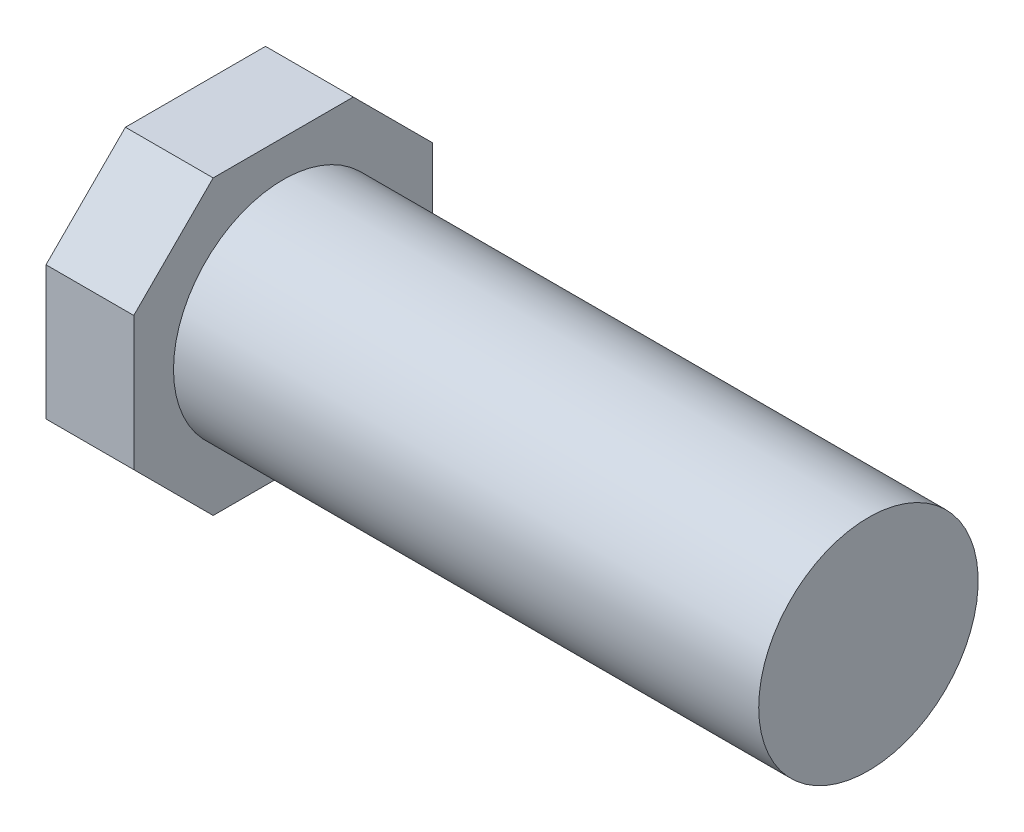
ISO-10303-21;
HEADER;
FILE_DESCRIPTION(('STEP AP214'),'2;1');
FILE_NAME('part.step','',(''),(''),'','','');
FILE_SCHEMA(('AUTOMOTIVE_DESIGN { 1 0 10303 214 1 1 1 1 }'));
ENDSEC;
DATA;
#1=APPLICATION_CONTEXT('core data for automotive mechanical design processes');
#2=APPLICATION_PROTOCOL_DEFINITION('international standard','automotive_design',2000,#1);
#3=PRODUCT_CONTEXT('',#1,'mechanical');
#4=PRODUCT('Part','Part','',(#3));
#5=PRODUCT_RELATED_PRODUCT_CATEGORY('part','',(#4));
#6=PRODUCT_DEFINITION_FORMATION('','',#4);
#7=PRODUCT_DEFINITION_CONTEXT('part definition',#1,'design');
#8=PRODUCT_DEFINITION('design','',#6,#7);
#9=PRODUCT_DEFINITION_SHAPE('','',#8);
#10=(LENGTH_UNIT() NAMED_UNIT(*) SI_UNIT(.MILLI.,.METRE.));
#11=(NAMED_UNIT(*) PLANE_ANGLE_UNIT() SI_UNIT($,.RADIAN.));
#12=(NAMED_UNIT(*) SI_UNIT($,.STERADIAN.) SOLID_ANGLE_UNIT());
#13=UNCERTAINTY_MEASURE_WITH_UNIT(LENGTH_MEASURE(1.E-05),#10,'distance_accuracy_value','');
#14=(GEOMETRIC_REPRESENTATION_CONTEXT(3) GLOBAL_UNCERTAINTY_ASSIGNED_CONTEXT((#13)) GLOBAL_UNIT_ASSIGNED_CONTEXT((#10,
#11,#12)) REPRESENTATION_CONTEXT('',''));
#15=CARTESIAN_POINT('',(0.,0.,0.));
#16=DIRECTION('',(0.,0.,1.));
#17=DIRECTION('',(1.,0.,0.));
#18=AXIS2_PLACEMENT_3D('',#15,#16,#17);
#19=CARTESIAN_POINT('',(74.9692086330936,7.78562045245583,-5.34476642061127));
#20=DIRECTION('',(-1.,0.,0.));
#21=DIRECTION('',(0.,0.,1.));
#22=AXIS2_PLACEMENT_3D('',#19,#20,#21);
#23=CYLINDRICAL_SURFACE('',#22,3.75);
#24=CARTESIAN_POINT('',(74.9692086330936,7.78562045245583,-5.34476642061127));
#25=DIRECTION('',(-1.,0.,0.));
#26=DIRECTION('',(0.,0.,1.));
#27=AXIS2_PLACEMENT_3D('',#24,#25,#26);
#28=CIRCLE('',#27,3.75);
#29=CARTESIAN_POINT('',(74.9692086330936,7.78562045245583,-1.59476642061127));
#30=VERTEX_POINT('',#29);
#31=EDGE_CURVE('E13',#30,#30,#28,.T.);
#32=ORIENTED_EDGE('',*,*,#31,.T.);
#33=EDGE_LOOP('',(#32));
#34=FACE_BOUND('',#33,.T.);
#35=CARTESIAN_POINT('',(54.9692086330936,7.78562045245583,-5.34476642061127));
#36=DIRECTION('',(-1.,0.,0.));
#37=DIRECTION('',(0.,0.,1.));
#38=AXIS2_PLACEMENT_3D('',#35,#36,#37);
#39=CIRCLE('',#38,3.75);
#40=CARTESIAN_POINT('',(54.9692086330936,7.78562045245583,-1.59476642061127));
#41=VERTEX_POINT('',#40);
#42=EDGE_CURVE('E47',#41,#41,#39,.F.);
#43=ORIENTED_EDGE('',*,*,#42,.T.);
#44=EDGE_LOOP('',(#43));
#45=FACE_BOUND('',#44,.T.);
#46=ADVANCED_FACE('F44',(#34,#45),#23,.T.);
#47=CARTESIAN_POINT('',(74.9692086330936,7.78562045245583,-5.34476642061127));
#48=DIRECTION('',(-1.,0.,0.));
#49=DIRECTION('',(0.,0.,1.));
#50=AXIS2_PLACEMENT_3D('',#47,#48,#49);
#51=PLANE('',#50);
#52=ORIENTED_EDGE('',*,*,#31,.F.);
#53=EDGE_LOOP('',(#52));
#54=FACE_BOUND('',#53,.T.);
#55=ADVANCED_FACE('F205',(#54),#51,.F.);
#56=CARTESIAN_POINT('',(54.9692086330936,12.7817875112535,-7.73889016917507));
#57=DIRECTION('',(0.,1.,0.));
#58=DIRECTION('',(0.,0.,1.));
#59=AXIS2_PLACEMENT_3D('',#56,#57,#58);
#60=PLANE('',#59);
#61=DIRECTION('',(0.,0.,-1.));
#62=VECTOR('',#61,1.);
#63=CARTESIAN_POINT('',(51.9692086330936,12.7817875112535,-7.73889016917507));
#64=LINE('',#63,#62);
#65=CARTESIAN_POINT('',(51.9692086330936,12.7817875112535,-2.95064267204748));
#66=VERTEX_POINT('',#65);
#67=CARTESIAN_POINT('',(51.9692086330936,12.7817875112535,-7.73889016917507));
#68=VERTEX_POINT('',#67);
#69=EDGE_CURVE('E140',#66,#68,#64,.T.);
#70=ORIENTED_EDGE('',*,*,#69,.F.);
#71=DIRECTION('',(-1.,0.,0.));
#72=VECTOR('',#71,1.);
#73=CARTESIAN_POINT('',(54.9692086330936,12.7817875112535,-2.95064267204748));
#74=LINE('',#73,#72);
#75=CARTESIAN_POINT('',(54.9692086330936,12.7817875112535,-2.95064267204748));
#76=VERTEX_POINT('',#75);
#77=EDGE_CURVE('E89',#76,#66,#74,.T.);
#78=ORIENTED_EDGE('',*,*,#77,.F.);
#79=DIRECTION('',(0.,0.,-1.));
#80=VECTOR('',#79,1.);
#81=CARTESIAN_POINT('',(54.9692086330936,12.7817875112535,-7.73889016917507));
#82=LINE('',#81,#80);
#83=CARTESIAN_POINT('',(54.9692086330936,12.7817875112535,-7.73889016917507));
#84=VERTEX_POINT('',#83);
#85=EDGE_CURVE('E159',#76,#84,#82,.T.);
#86=ORIENTED_EDGE('',*,*,#85,.T.);
#87=DIRECTION('',(-1.,0.,0.));
#88=VECTOR('',#87,1.);
#89=CARTESIAN_POINT('',(54.9692086330936,12.7817875112535,-7.73889016917507));
#90=LINE('',#89,#88);
#91=EDGE_CURVE('E97',#84,#68,#90,.T.);
#92=ORIENTED_EDGE('',*,*,#91,.T.);
#93=EDGE_LOOP('',(#70,#78,#86,#92));
#94=FACE_BOUND('',#93,.T.);
#95=ADVANCED_FACE('F172',(#94),#60,.T.);
#96=CARTESIAN_POINT('',(54.9692086330936,11.4259112598173,-1.59476642061127));
#97=DIRECTION('',(0.,0.707106781186551,0.707106781186544));
#98=DIRECTION('',(0.,-0.707106781186544,0.707106781186551));
#99=AXIS2_PLACEMENT_3D('',#96,#97,#98);
#100=PLANE('',#99);
#101=DIRECTION('',(0.,0.707106781186544,-0.707106781186551));
#102=VECTOR('',#101,1.);
#103=CARTESIAN_POINT('',(51.9692086330936,11.4259112598173,-1.59476642061127));
#104=LINE('',#103,#102);
#105=CARTESIAN_POINT('',(51.9692086330936,10.0682662399391,-0.23712140073313));
#106=VERTEX_POINT('',#105);
#107=EDGE_CURVE('E86',#106,#66,#104,.T.);
#108=ORIENTED_EDGE('',*,*,#107,.F.);
#109=DIRECTION('',(-1.,0.,0.));
#110=VECTOR('',#109,1.);
#111=CARTESIAN_POINT('',(54.9692086330936,10.0682662399391,-0.23712140073313));
#112=LINE('',#111,#110);
#113=CARTESIAN_POINT('',(54.9692086330936,10.0682662399391,-0.23712140073313));
#114=VERTEX_POINT('',#113);
#115=EDGE_CURVE('E132',#114,#106,#112,.T.);
#116=ORIENTED_EDGE('',*,*,#115,.F.);
#117=DIRECTION('',(0.,0.707106781186556,-0.707106781186539));
#118=VECTOR('',#117,1.);
#119=CARTESIAN_POINT('',(54.9692086330936,11.4259112598173,-1.59476642061127));
#120=LINE('',#119,#118);
#121=EDGE_CURVE('E60',#114,#76,#120,.T.);
#122=ORIENTED_EDGE('',*,*,#121,.T.);
#123=ORIENTED_EDGE('',*,*,#77,.T.);
#124=EDGE_LOOP('',(#108,#116,#122,#123));
#125=FACE_BOUND('',#124,.T.);
#126=ADVANCED_FACE('F225',(#125),#100,.T.);
#127=CARTESIAN_POINT('',(54.9692086330936,5.50297466497254,-0.237121400733137));
#128=DIRECTION('',(0.,0.,1.));
#129=DIRECTION('',(0.,-1.,0.));
#130=AXIS2_PLACEMENT_3D('',#127,#128,#129);
#131=PLANE('',#130);
#132=DIRECTION('',(0.,1.,0.));
#133=VECTOR('',#132,1.);
#134=CARTESIAN_POINT('',(51.9692086330936,5.50297466497254,-0.237121400733137));
#135=LINE('',#134,#133);
#136=CARTESIAN_POINT('',(51.9692086330936,5.50297466497254,-0.237121400733137));
#137=VERTEX_POINT('',#136);
#138=EDGE_CURVE('E130',#137,#106,#135,.T.);
#139=ORIENTED_EDGE('',*,*,#138,.F.);
#140=DIRECTION('',(-1.,0.,0.));
#141=VECTOR('',#140,1.);
#142=CARTESIAN_POINT('',(54.9692086330936,5.50297466497254,-0.237121400733137));
#143=LINE('',#142,#141);
#144=CARTESIAN_POINT('',(54.9692086330936,5.50297466497254,-0.237121400733137));
#145=VERTEX_POINT('',#144);
#146=EDGE_CURVE('E115',#145,#137,#143,.T.);
#147=ORIENTED_EDGE('',*,*,#146,.F.);
#148=DIRECTION('',(0.,1.,0.));
#149=VECTOR('',#148,1.);
#150=CARTESIAN_POINT('',(54.9692086330936,5.50297466497254,-0.237121400733137));
#151=LINE('',#150,#149);
#152=EDGE_CURVE('E123',#145,#114,#151,.T.);
#153=ORIENTED_EDGE('',*,*,#152,.T.);
#154=ORIENTED_EDGE('',*,*,#115,.T.);
#155=EDGE_LOOP('',(#139,#147,#153,#154));
#156=FACE_BOUND('',#155,.T.);
#157=ADVANCED_FACE('F128',(#156),#131,.T.);
#158=CARTESIAN_POINT('',(54.9692086330936,4.14532964509439,-1.59476642061127));
#159=DIRECTION('',(0.,-0.707106781186543,0.707106781186552));
#160=DIRECTION('',(0.,-0.707106781186552,-0.707106781186543));
#161=AXIS2_PLACEMENT_3D('',#158,#159,#160);
#162=PLANE('',#161);
#163=DIRECTION('',(0.,0.707106781186552,0.707106781186543));
#164=VECTOR('',#163,1.);
#165=CARTESIAN_POINT('',(51.9692086330936,4.14532964509439,-1.59476642061127));
#166=LINE('',#165,#164);
#167=CARTESIAN_POINT('',(51.9692086330936,2.78945339365822,-2.95064267204748));
#168=VERTEX_POINT('',#167);
#169=EDGE_CURVE('E155',#168,#137,#166,.T.);
#170=ORIENTED_EDGE('',*,*,#169,.F.);
#171=DIRECTION('',(-1.,0.,0.));
#172=VECTOR('',#171,1.);
#173=CARTESIAN_POINT('',(54.9692086330936,2.78945339365822,-2.95064267204748));
#174=LINE('',#173,#172);
#175=CARTESIAN_POINT('',(54.9692086330936,2.78945339365822,-2.95064267204748));
#176=VERTEX_POINT('',#175);
#177=EDGE_CURVE('E118',#176,#168,#174,.T.);
#178=ORIENTED_EDGE('',*,*,#177,.F.);
#179=DIRECTION('',(0.,0.707106781186536,0.707106781186559));
#180=VECTOR('',#179,1.);
#181=CARTESIAN_POINT('',(54.9692086330936,2.78945339365822,-2.95064267204748));
#182=LINE('',#181,#180);
#183=EDGE_CURVE('E112',#176,#145,#182,.T.);
#184=ORIENTED_EDGE('',*,*,#183,.T.);
#185=ORIENTED_EDGE('',*,*,#146,.T.);
#186=EDGE_LOOP('',(#170,#178,#184,#185));
#187=FACE_BOUND('',#186,.T.);
#188=ADVANCED_FACE('F114',(#187),#162,.T.);
#189=CARTESIAN_POINT('',(54.9692086330936,2.78945339365822,-7.73889016917507));
#190=DIRECTION('',(0.,-1.,0.));
#191=DIRECTION('',(0.,0.,-1.));
#192=AXIS2_PLACEMENT_3D('',#189,#190,#191);
#193=PLANE('',#192);
#194=DIRECTION('',(0.,0.,1.));
#195=VECTOR('',#194,1.);
#196=CARTESIAN_POINT('',(51.9692086330936,2.78945339365822,-7.73889016917507));
#197=LINE('',#196,#195);
#198=CARTESIAN_POINT('',(51.9692086330936,2.78945339365822,-7.73889016917507));
#199=VERTEX_POINT('',#198);
#200=EDGE_CURVE('E152',#199,#168,#197,.T.);
#201=ORIENTED_EDGE('',*,*,#200,.F.);
#202=DIRECTION('',(-1.,0.,0.));
#203=VECTOR('',#202,1.);
#204=CARTESIAN_POINT('',(54.9692086330936,2.78945339365822,-7.73889016917507));
#205=LINE('',#204,#203);
#206=CARTESIAN_POINT('',(54.9692086330936,2.78945339365822,-7.73889016917507));
#207=VERTEX_POINT('',#206);
#208=EDGE_CURVE('E163',#207,#199,#205,.T.);
#209=ORIENTED_EDGE('',*,*,#208,.F.);
#210=DIRECTION('',(0.,0.,1.));
#211=VECTOR('',#210,1.);
#212=CARTESIAN_POINT('',(54.9692086330936,2.78945339365822,-7.73889016917507));
#213=LINE('',#212,#211);
#214=EDGE_CURVE('E124',#207,#176,#213,.T.);
#215=ORIENTED_EDGE('',*,*,#214,.T.);
#216=ORIENTED_EDGE('',*,*,#177,.T.);
#217=EDGE_LOOP('',(#201,#209,#215,#216));
#218=FACE_BOUND('',#217,.T.);
#219=ADVANCED_FACE('F177',(#218),#193,.T.);
#220=CARTESIAN_POINT('',(54.9692086330936,4.14532964509439,-9.09476642061127));
#221=DIRECTION('',(0.,-0.707106781186554,-0.707106781186541));
#222=DIRECTION('',(0.,0.707106781186541,-0.707106781186554));
#223=AXIS2_PLACEMENT_3D('',#220,#221,#222);
#224=PLANE('',#223);
#225=DIRECTION('',(0.,-0.707106781186541,0.707106781186554));
#226=VECTOR('',#225,1.);
#227=CARTESIAN_POINT('',(51.9692086330936,4.14532964509439,-9.09476642061127));
#228=LINE('',#227,#226);
#229=CARTESIAN_POINT('',(51.9692086330936,5.50297466497255,-10.4524114404894));
#230=VERTEX_POINT('',#229);
#231=EDGE_CURVE('E149',#230,#199,#228,.T.);
#232=ORIENTED_EDGE('',*,*,#231,.F.);
#233=DIRECTION('',(-1.,0.,0.));
#234=VECTOR('',#233,1.);
#235=CARTESIAN_POINT('',(54.9692086330936,5.50297466497255,-10.4524114404894));
#236=LINE('',#235,#234);
#237=CARTESIAN_POINT('',(54.9692086330936,5.50297466497255,-10.4524114404894));
#238=VERTEX_POINT('',#237);
#239=EDGE_CURVE('E165',#238,#230,#236,.T.);
#240=ORIENTED_EDGE('',*,*,#239,.F.);
#241=DIRECTION('',(0.,-0.707106781186554,0.707106781186541));
#242=VECTOR('',#241,1.);
#243=CARTESIAN_POINT('',(54.9692086330936,4.14532964509439,-9.09476642061127));
#244=LINE('',#243,#242);
#245=EDGE_CURVE('E180',#238,#207,#244,.T.);
#246=ORIENTED_EDGE('',*,*,#245,.T.);
#247=ORIENTED_EDGE('',*,*,#208,.T.);
#248=EDGE_LOOP('',(#232,#240,#246,#247));
#249=FACE_BOUND('',#248,.T.);
#250=ADVANCED_FACE('F195',(#249),#224,.T.);
#251=CARTESIAN_POINT('',(54.9692086330936,5.50297466497255,-10.4524114404894));
#252=DIRECTION('',(0.,0.,-1.));
#253=DIRECTION('',(-1.,0.,0.));
#254=AXIS2_PLACEMENT_3D('',#251,#252,#253);
#255=PLANE('',#254);
#256=DIRECTION('',(0.,-1.,0.));
#257=VECTOR('',#256,1.);
#258=CARTESIAN_POINT('',(51.9692086330936,5.50297466497255,-10.4524114404894));
#259=LINE('',#258,#257);
#260=CARTESIAN_POINT('',(51.9692086330936,10.0682662399391,-10.4524114404894));
#261=VERTEX_POINT('',#260);
#262=EDGE_CURVE('E146',#261,#230,#259,.T.);
#263=ORIENTED_EDGE('',*,*,#262,.F.);
#264=DIRECTION('',(-1.,0.,0.));
#265=VECTOR('',#264,1.);
#266=CARTESIAN_POINT('',(54.9692086330936,10.0682662399391,-10.4524114404894));
#267=LINE('',#266,#265);
#268=CARTESIAN_POINT('',(54.9692086330936,10.0682662399391,-10.4524114404894));
#269=VERTEX_POINT('',#268);
#270=EDGE_CURVE('E168',#269,#261,#267,.T.);
#271=ORIENTED_EDGE('',*,*,#270,.F.);
#272=DIRECTION('',(0.,-1.,0.));
#273=VECTOR('',#272,1.);
#274=CARTESIAN_POINT('',(54.9692086330936,5.50297466497255,-10.4524114404894));
#275=LINE('',#274,#273);
#276=EDGE_CURVE('E181',#269,#238,#275,.T.);
#277=ORIENTED_EDGE('',*,*,#276,.T.);
#278=ORIENTED_EDGE('',*,*,#239,.T.);
#279=EDGE_LOOP('',(#263,#271,#277,#278));
#280=FACE_BOUND('',#279,.T.);
#281=ADVANCED_FACE('F193',(#280),#255,.T.);
#282=CARTESIAN_POINT('',(54.9692086330936,11.4259112598173,-9.09476642061127));
#283=DIRECTION('',(0.,0.707106781186541,-0.707106781186554));
#284=DIRECTION('',(0.,0.707106781186554,0.707106781186541));
#285=AXIS2_PLACEMENT_3D('',#282,#283,#284);
#286=PLANE('',#285);
#287=DIRECTION('',(0.,-0.707106781186554,-0.707106781186541));
#288=VECTOR('',#287,1.);
#289=CARTESIAN_POINT('',(51.9692086330936,11.4259112598173,-9.09476642061127));
#290=LINE('',#289,#288);
#291=EDGE_CURVE('E143',#68,#261,#290,.T.);
#292=ORIENTED_EDGE('',*,*,#291,.F.);
#293=ORIENTED_EDGE('',*,*,#91,.F.);
#294=DIRECTION('',(0.,-0.707106781186549,-0.707106781186546));
#295=VECTOR('',#294,1.);
#296=CARTESIAN_POINT('',(54.9692086330936,11.4259112598173,-9.09476642061127));
#297=LINE('',#296,#295);
#298=EDGE_CURVE('E186',#84,#269,#297,.T.);
#299=ORIENTED_EDGE('',*,*,#298,.T.);
#300=ORIENTED_EDGE('',*,*,#270,.T.);
#301=EDGE_LOOP('',(#292,#293,#299,#300));
#302=FACE_BOUND('',#301,.T.);
#303=ADVANCED_FACE('F189',(#302),#286,.T.);
#304=CARTESIAN_POINT('',(54.9692086330936,0.,0.));
#305=DIRECTION('',(-1.,0.,0.));
#306=DIRECTION('',(0.,0.,1.));
#307=AXIS2_PLACEMENT_3D('',#304,#305,#306);
#308=PLANE('',#307);
#309=ORIENTED_EDGE('',*,*,#42,.F.);
#310=EDGE_LOOP('',(#309));
#311=FACE_BOUND('',#310,.T.);
#312=ORIENTED_EDGE('',*,*,#85,.F.);
#313=ORIENTED_EDGE('',*,*,#121,.F.);
#314=ORIENTED_EDGE('',*,*,#152,.F.);
#315=ORIENTED_EDGE('',*,*,#183,.F.);
#316=ORIENTED_EDGE('',*,*,#214,.F.);
#317=ORIENTED_EDGE('',*,*,#245,.F.);
#318=ORIENTED_EDGE('',*,*,#276,.F.);
#319=ORIENTED_EDGE('',*,*,#298,.F.);
#320=EDGE_LOOP('',(#312,#313,#314,#315,#316,#317,#318,#319));
#321=FACE_BOUND('',#320,.T.);
#322=ADVANCED_FACE('F135',(#311,#321),#308,.F.);
#323=CARTESIAN_POINT('',(51.9692086330936,7.78562045245583,-5.34476642061127));
#324=DIRECTION('',(-1.,0.,0.));
#325=DIRECTION('',(0.,0.,1.));
#326=AXIS2_PLACEMENT_3D('',#323,#324,#325);
#327=PLANE('',#326);
#328=ORIENTED_EDGE('',*,*,#69,.T.);
#329=ORIENTED_EDGE('',*,*,#291,.T.);
#330=ORIENTED_EDGE('',*,*,#262,.T.);
#331=ORIENTED_EDGE('',*,*,#231,.T.);
#332=ORIENTED_EDGE('',*,*,#200,.T.);
#333=ORIENTED_EDGE('',*,*,#169,.T.);
#334=ORIENTED_EDGE('',*,*,#138,.T.);
#335=ORIENTED_EDGE('',*,*,#107,.T.);
#336=EDGE_LOOP('',(#328,#329,#330,#331,#332,#333,#334,#335));
#337=FACE_BOUND('',#336,.T.);
#338=ADVANCED_FACE('F174',(#337),#327,.T.);
#339=CLOSED_SHELL('',(#46,#55,#95,#126,#157,#188,#219,#250,#281,#303,#322,#338));
#340=MANIFOLD_SOLID_BREP('B2',#339);
#341=ADVANCED_BREP_SHAPE_REPRESENTATION('',(#18,#340),#14);
#342=SHAPE_DEFINITION_REPRESENTATION(#9,#341);
ENDSEC;
END-ISO-10303-21;
